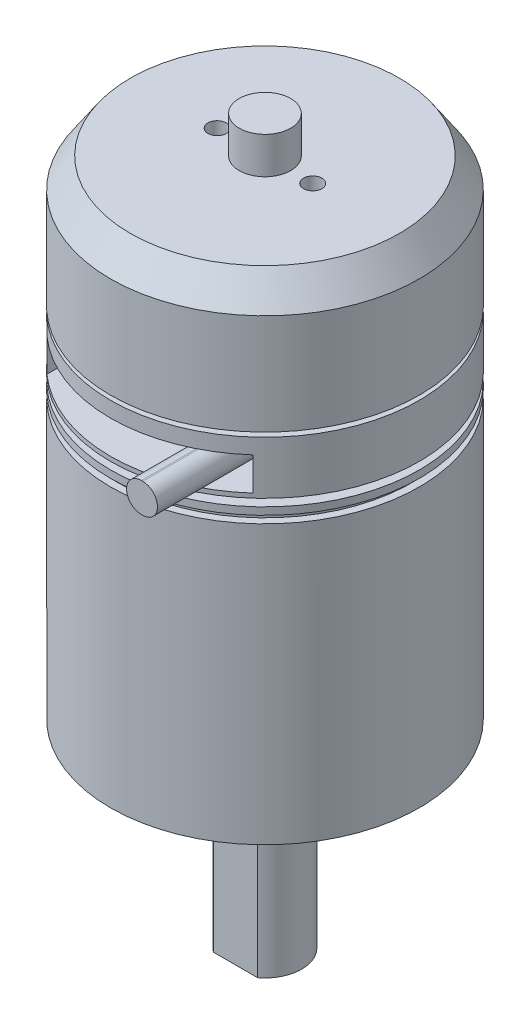
ISO-10303-21;
HEADER;
FILE_DESCRIPTION(('STEP AP214'),'2;1');
FILE_NAME('part.step','',(''),(''),'','','');
FILE_SCHEMA(('AUTOMOTIVE_DESIGN { 1 0 10303 214 1 1 1 1 }'));
ENDSEC;
DATA;
#1=APPLICATION_CONTEXT('core data for automotive mechanical design processes');
#2=APPLICATION_PROTOCOL_DEFINITION('international standard','automotive_design',2000,#1);
#3=PRODUCT_CONTEXT('',#1,'mechanical');
#4=PRODUCT('Part','Part','',(#3));
#5=PRODUCT_RELATED_PRODUCT_CATEGORY('part','',(#4));
#6=PRODUCT_DEFINITION_FORMATION('','',#4);
#7=PRODUCT_DEFINITION_CONTEXT('part definition',#1,'design');
#8=PRODUCT_DEFINITION('design','',#6,#7);
#9=PRODUCT_DEFINITION_SHAPE('','',#8);
#10=(LENGTH_UNIT() NAMED_UNIT(*) SI_UNIT(.MILLI.,.METRE.));
#11=(NAMED_UNIT(*) PLANE_ANGLE_UNIT() SI_UNIT($,.RADIAN.));
#12=(NAMED_UNIT(*) SI_UNIT($,.STERADIAN.) SOLID_ANGLE_UNIT());
#13=UNCERTAINTY_MEASURE_WITH_UNIT(LENGTH_MEASURE(1.E-05),#10,'distance_accuracy_value','');
#14=(GEOMETRIC_REPRESENTATION_CONTEXT(3) GLOBAL_UNCERTAINTY_ASSIGNED_CONTEXT((#13)) GLOBAL_UNIT_ASSIGNED_CONTEXT((#10,
#11,#12)) REPRESENTATION_CONTEXT('',''));
#15=CARTESIAN_POINT('',(0.,0.,0.));
#16=DIRECTION('',(0.,0.,1.));
#17=DIRECTION('',(1.,0.,0.));
#18=AXIS2_PLACEMENT_3D('',#15,#16,#17);
#19=CARTESIAN_POINT('',(0.,0.,11.));
#20=DIRECTION('',(0.,0.,1.));
#21=DIRECTION('',(1.,0.,0.));
#22=AXIS2_PLACEMENT_3D('',#19,#20,#21);
#23=PLANE('',#22);
#24=DIRECTION('',(0.,1.,0.));
#25=VECTOR('',#24,1.);
#26=CARTESIAN_POINT('',(14.,18.3,11.));
#27=LINE('',#26,#25);
#28=CARTESIAN_POINT('',(14.,13.8,11.));
#29=VERTEX_POINT('',#28);
#30=CARTESIAN_POINT('',(14.,18.3,11.));
#31=VERTEX_POINT('',#30);
#32=EDGE_CURVE('E278',#29,#31,#27,.T.);
#33=ORIENTED_EDGE('',*,*,#32,.T.);
#34=DIRECTION('',(-1.,0.,0.));
#35=VECTOR('',#34,1.);
#36=CARTESIAN_POINT('',(-14.,18.3,11.));
#37=LINE('',#36,#35);
#38=CARTESIAN_POINT('',(-14.,18.3,11.));
#39=VERTEX_POINT('',#38);
#40=EDGE_CURVE('E281',#31,#39,#37,.T.);
#41=ORIENTED_EDGE('',*,*,#40,.T.);
#42=DIRECTION('',(0.,-1.,0.));
#43=VECTOR('',#42,1.);
#44=CARTESIAN_POINT('',(-14.,18.3,11.));
#45=LINE('',#44,#43);
#46=CARTESIAN_POINT('',(-14.,13.8,11.));
#47=VERTEX_POINT('',#46);
#48=EDGE_CURVE('E285',#39,#47,#45,.T.);
#49=ORIENTED_EDGE('',*,*,#48,.T.);
#50=DIRECTION('',(1.,0.,0.));
#51=VECTOR('',#50,1.);
#52=CARTESIAN_POINT('',(-14.,13.8,11.));
#53=LINE('',#52,#51);
#54=EDGE_CURVE('E289',#47,#29,#53,.T.);
#55=ORIENTED_EDGE('',*,*,#54,.T.);
#56=EDGE_LOOP('',(#33,#41,#49,#55));
#57=FACE_BOUND('',#56,.T.);
#58=DIRECTION('',(1.,0.,0.));
#59=VECTOR('',#58,1.);
#60=CARTESIAN_POINT('',(9.18505632343501,14.0531944170925,11.));
#61=LINE('',#60,#59);
#62=CARTESIAN_POINT('',(9.18505632343501,14.0531944170925,11.));
#63=VERTEX_POINT('',#62);
#64=CARTESIAN_POINT('',(9.38505632343501,14.0531944170925,11.));
#65=VERTEX_POINT('',#64);
#66=EDGE_CURVE('E258',#63,#65,#61,.T.);
#67=ORIENTED_EDGE('',*,*,#66,.F.);
#68=CARTESIAN_POINT('',(9.18505632343501,16.0531944170925,11.));
#69=DIRECTION('',(0.,0.,1.));
#70=DIRECTION('',(1.,0.,0.));
#71=AXIS2_PLACEMENT_3D('',#68,#69,#70);
#72=CIRCLE('',#71,1.99999999999999);
#73=CARTESIAN_POINT('',(9.18505632343501,18.0531944170925,11.));
#74=VERTEX_POINT('',#73);
#75=EDGE_CURVE('E239',#74,#63,#72,.T.);
#76=ORIENTED_EDGE('',*,*,#75,.F.);
#77=DIRECTION('',(-1.,0.,0.));
#78=VECTOR('',#77,1.);
#79=CARTESIAN_POINT('',(9.18505632343501,18.0531944170925,11.));
#80=LINE('',#79,#78);
#81=CARTESIAN_POINT('',(9.38505632343501,18.0531944170925,11.));
#82=VERTEX_POINT('',#81);
#83=EDGE_CURVE('E245',#82,#74,#80,.T.);
#84=ORIENTED_EDGE('',*,*,#83,.F.);
#85=CARTESIAN_POINT('',(9.38505632343501,16.0531944170925,11.));
#86=DIRECTION('',(0.,0.,1.));
#87=DIRECTION('',(1.,0.,0.));
#88=AXIS2_PLACEMENT_3D('',#85,#86,#87);
#89=CIRCLE('',#88,2.);
#90=EDGE_CURVE('E261',#65,#82,#89,.T.);
#91=ORIENTED_EDGE('',*,*,#90,.F.);
#92=EDGE_LOOP('',(#67,#76,#84,#91));
#93=FACE_BOUND('',#92,.T.);
#94=ADVANCED_FACE('F43',(#57,#93),#23,.T.);
#95=CARTESIAN_POINT('',(0.,43.7,0.));
#96=DIRECTION('',(0.,1.,0.));
#97=DIRECTION('',(0.,0.,1.));
#98=AXIS2_PLACEMENT_3D('',#95,#96,#97);
#99=CYLINDRICAL_SURFACE('',#98,21.);
#100=CARTESIAN_POINT('',(0.,10.2,0.));
#101=DIRECTION('',(0.,1.,0.));
#102=DIRECTION('',(0.,0.,1.));
#103=AXIS2_PLACEMENT_3D('',#100,#101,#102);
#104=CIRCLE('',#103,21.);
#105=CARTESIAN_POINT('',(0.,10.2,21.));
#106=VERTEX_POINT('',#105);
#107=EDGE_CURVE('E369',#106,#106,#104,.T.);
#108=ORIENTED_EDGE('',*,*,#107,.F.);
#109=EDGE_LOOP('',(#108));
#110=FACE_BOUND('',#109,.T.);
#111=CARTESIAN_POINT('',(0.,-27.6,0.));
#112=DIRECTION('',(0.,1.,0.));
#113=DIRECTION('',(-1.,0.,0.));
#114=AXIS2_PLACEMENT_3D('',#111,#112,#113);
#115=CIRCLE('',#114,21.);
#116=CARTESIAN_POINT('',(-21.,-27.6,0.));
#117=VERTEX_POINT('',#116);
#118=EDGE_CURVE('E193',#117,#117,#115,.T.);
#119=ORIENTED_EDGE('',*,*,#118,.T.);
#120=EDGE_LOOP('',(#119));
#121=FACE_BOUND('',#120,.T.);
#122=ADVANCED_FACE('F45',(#110,#121),#99,.T.);
#123=CARTESIAN_POINT('',(21.,10.2,0.));
#124=DIRECTION('',(0.,-1.,0.));
#125=DIRECTION('',(0.,0.,-1.));
#126=AXIS2_PLACEMENT_3D('',#123,#124,#125);
#127=PLANE('',#126);
#128=CARTESIAN_POINT('',(0.,10.2,0.));
#129=DIRECTION('',(0.,1.,0.));
#130=DIRECTION('',(0.,0.,1.));
#131=AXIS2_PLACEMENT_3D('',#128,#129,#130);
#132=CIRCLE('',#131,20.);
#133=CARTESIAN_POINT('',(0.,10.2,20.));
#134=VERTEX_POINT('',#133);
#135=EDGE_CURVE('E365',#134,#134,#132,.T.);
#136=ORIENTED_EDGE('',*,*,#135,.F.);
#137=EDGE_LOOP('',(#136));
#138=FACE_BOUND('',#137,.T.);
#139=ORIENTED_EDGE('',*,*,#107,.T.);
#140=EDGE_LOOP('',(#139));
#141=FACE_BOUND('',#140,.T.);
#142=ADVANCED_FACE('F416',(#138,#141),#127,.F.);
#143=CARTESIAN_POINT('',(0.,43.7,0.));
#144=DIRECTION('',(0.,1.,0.));
#145=DIRECTION('',(0.,0.,1.));
#146=AXIS2_PLACEMENT_3D('',#143,#144,#145);
#147=CYLINDRICAL_SURFACE('',#146,20.);
#148=CARTESIAN_POINT('',(0.,11.2,0.));
#149=DIRECTION('',(0.,1.,0.));
#150=DIRECTION('',(0.,0.,1.));
#151=AXIS2_PLACEMENT_3D('',#148,#149,#150);
#152=CIRCLE('',#151,20.);
#153=CARTESIAN_POINT('',(0.,11.2,20.));
#154=VERTEX_POINT('',#153);
#155=EDGE_CURVE('E361',#154,#154,#152,.T.);
#156=ORIENTED_EDGE('',*,*,#155,.F.);
#157=EDGE_LOOP('',(#156));
#158=FACE_BOUND('',#157,.T.);
#159=ORIENTED_EDGE('',*,*,#135,.T.);
#160=EDGE_LOOP('',(#159));
#161=FACE_BOUND('',#160,.T.);
#162=ADVANCED_FACE('F480',(#158,#161),#147,.T.);
#163=CARTESIAN_POINT('',(20.,11.2,0.));
#164=DIRECTION('',(0.,1.,0.));
#165=DIRECTION('',(0.,0.,1.));
#166=AXIS2_PLACEMENT_3D('',#163,#164,#165);
#167=PLANE('',#166);
#168=CARTESIAN_POINT('',(0.,11.2,0.));
#169=DIRECTION('',(0.,1.,0.));
#170=DIRECTION('',(0.,0.,1.));
#171=AXIS2_PLACEMENT_3D('',#168,#169,#170);
#172=CIRCLE('',#171,21.);
#173=CARTESIAN_POINT('',(0.,11.2,21.));
#174=VERTEX_POINT('',#173);
#175=EDGE_CURVE('E357',#174,#174,#172,.T.);
#176=ORIENTED_EDGE('',*,*,#175,.F.);
#177=EDGE_LOOP('',(#176));
#178=FACE_BOUND('',#177,.T.);
#179=ORIENTED_EDGE('',*,*,#155,.T.);
#180=EDGE_LOOP('',(#179));
#181=FACE_BOUND('',#180,.T.);
#182=ADVANCED_FACE('F476',(#178,#181),#167,.F.);
#183=CARTESIAN_POINT('',(0.,43.7,0.));
#184=DIRECTION('',(0.,1.,0.));
#185=DIRECTION('',(0.,0.,1.));
#186=AXIS2_PLACEMENT_3D('',#183,#184,#185);
#187=CYLINDRICAL_SURFACE('',#186,21.);
#188=CARTESIAN_POINT('',(0.,12.2,0.));
#189=DIRECTION('',(0.,1.,0.));
#190=DIRECTION('',(0.,0.,1.));
#191=AXIS2_PLACEMENT_3D('',#188,#189,#190);
#192=CIRCLE('',#191,21.);
#193=CARTESIAN_POINT('',(0.,12.2,21.));
#194=VERTEX_POINT('',#193);
#195=EDGE_CURVE('E353',#194,#194,#192,.T.);
#196=ORIENTED_EDGE('',*,*,#195,.F.);
#197=EDGE_LOOP('',(#196));
#198=FACE_BOUND('',#197,.T.);
#199=ORIENTED_EDGE('',*,*,#175,.T.);
#200=EDGE_LOOP('',(#199));
#201=FACE_BOUND('',#200,.T.);
#202=ADVANCED_FACE('F472',(#198,#201),#187,.T.);
#203=CARTESIAN_POINT('',(21.,12.2,0.));
#204=DIRECTION('',(0.,-1.,0.));
#205=DIRECTION('',(0.,0.,-1.));
#206=AXIS2_PLACEMENT_3D('',#203,#204,#205);
#207=PLANE('',#206);
#208=CARTESIAN_POINT('',(0.,12.2,0.));
#209=DIRECTION('',(0.,1.,0.));
#210=DIRECTION('',(0.,0.,1.));
#211=AXIS2_PLACEMENT_3D('',#208,#209,#210);
#212=CIRCLE('',#211,10.);
#213=CARTESIAN_POINT('',(0.,12.2,10.));
#214=VERTEX_POINT('',#213);
#215=EDGE_CURVE('E349',#214,#214,#212,.T.);
#216=ORIENTED_EDGE('',*,*,#215,.F.);
#217=EDGE_LOOP('',(#216));
#218=FACE_BOUND('',#217,.T.);
#219=ORIENTED_EDGE('',*,*,#195,.T.);
#220=EDGE_LOOP('',(#219));
#221=FACE_BOUND('',#220,.T.);
#222=ADVANCED_FACE('F468',(#218,#221),#207,.F.);
#223=CARTESIAN_POINT('',(0.,43.7,0.));
#224=DIRECTION('',(0.,1.,0.));
#225=DIRECTION('',(0.,0.,1.));
#226=AXIS2_PLACEMENT_3D('',#223,#224,#225);
#227=CYLINDRICAL_SURFACE('',#226,10.);
#228=CARTESIAN_POINT('',(0.,13.2,0.));
#229=DIRECTION('',(0.,1.,0.));
#230=DIRECTION('',(0.,0.,1.));
#231=AXIS2_PLACEMENT_3D('',#228,#229,#230);
#232=CIRCLE('',#231,10.);
#233=CARTESIAN_POINT('',(0.,13.2,10.));
#234=VERTEX_POINT('',#233);
#235=EDGE_CURVE('E345',#234,#234,#232,.T.);
#236=ORIENTED_EDGE('',*,*,#235,.F.);
#237=EDGE_LOOP('',(#236));
#238=FACE_BOUND('',#237,.T.);
#239=ORIENTED_EDGE('',*,*,#215,.T.);
#240=EDGE_LOOP('',(#239));
#241=FACE_BOUND('',#240,.T.);
#242=ADVANCED_FACE('F464',(#238,#241),#227,.T.);
#243=CARTESIAN_POINT('',(10.,13.2,0.));
#244=DIRECTION('',(0.,1.,0.));
#245=DIRECTION('',(0.,0.,1.));
#246=AXIS2_PLACEMENT_3D('',#243,#244,#245);
#247=PLANE('',#246);
#248=CARTESIAN_POINT('',(0.,13.2,0.));
#249=DIRECTION('',(0.,1.,0.));
#250=DIRECTION('',(0.,0.,1.));
#251=AXIS2_PLACEMENT_3D('',#248,#249,#250);
#252=CIRCLE('',#251,21.);
#253=CARTESIAN_POINT('',(0.,13.2,21.));
#254=VERTEX_POINT('',#253);
#255=EDGE_CURVE('E341',#254,#254,#252,.T.);
#256=ORIENTED_EDGE('',*,*,#255,.F.);
#257=EDGE_LOOP('',(#256));
#258=FACE_BOUND('',#257,.T.);
#259=ORIENTED_EDGE('',*,*,#235,.T.);
#260=EDGE_LOOP('',(#259));
#261=FACE_BOUND('',#260,.T.);
#262=ADVANCED_FACE('F461',(#258,#261),#247,.F.);
#263=CARTESIAN_POINT('',(0.,43.7,0.));
#264=DIRECTION('',(0.,1.,0.));
#265=DIRECTION('',(0.,0.,1.));
#266=AXIS2_PLACEMENT_3D('',#263,#264,#265);
#267=CYLINDRICAL_SURFACE('',#266,21.);
#268=CARTESIAN_POINT('',(0.,18.3,0.));
#269=DIRECTION('',(0.,1.,0.));
#270=DIRECTION('',(0.,0.,1.));
#271=AXIS2_PLACEMENT_3D('',#268,#269,#270);
#272=CIRCLE('',#271,21.);
#273=CARTESIAN_POINT('',(-14.,18.3,15.6524758424985));
#274=VERTEX_POINT('',#273);
#275=CARTESIAN_POINT('',(14.,18.3,15.6524758424985));
#276=VERTEX_POINT('',#275);
#277=EDGE_CURVE('E373',#274,#276,#272,.T.);
#278=ORIENTED_EDGE('',*,*,#277,.T.);
#279=DIRECTION('',(0.,1.,0.));
#280=VECTOR('',#279,1.);
#281=CARTESIAN_POINT('',(14.,43.7,15.6524758424985));
#282=LINE('',#281,#280);
#283=CARTESIAN_POINT('',(14.,13.8,15.6524758424985));
#284=VERTEX_POINT('',#283);
#285=EDGE_CURVE('E11',#276,#284,#282,.F.);
#286=ORIENTED_EDGE('',*,*,#285,.T.);
#287=CARTESIAN_POINT('',(0.,13.8,0.));
#288=DIRECTION('',(0.,-1.,0.));
#289=DIRECTION('',(0.,0.,-1.));
#290=AXIS2_PLACEMENT_3D('',#287,#288,#289);
#291=CIRCLE('',#290,21.);
#292=CARTESIAN_POINT('',(-14.,13.8,15.6524758424985));
#293=VERTEX_POINT('',#292);
#294=EDGE_CURVE('E52',#284,#293,#291,.T.);
#295=ORIENTED_EDGE('',*,*,#294,.T.);
#296=DIRECTION('',(0.,1.,0.));
#297=VECTOR('',#296,1.);
#298=CARTESIAN_POINT('',(-14.,43.7,15.6524758424985));
#299=LINE('',#298,#297);
#300=EDGE_CURVE('E376',#293,#274,#299,.T.);
#301=ORIENTED_EDGE('',*,*,#300,.T.);
#302=EDGE_LOOP('',(#278,#286,#295,#301));
#303=FACE_BOUND('',#302,.T.);
#304=CARTESIAN_POINT('',(0.,20.4,0.));
#305=DIRECTION('',(0.,1.,0.));
#306=DIRECTION('',(0.,0.,1.));
#307=AXIS2_PLACEMENT_3D('',#304,#305,#306);
#308=CIRCLE('',#307,21.);
#309=CARTESIAN_POINT('',(0.,20.4,21.));
#310=VERTEX_POINT('',#309);
#311=EDGE_CURVE('E337',#310,#310,#308,.T.);
#312=ORIENTED_EDGE('',*,*,#311,.F.);
#313=EDGE_LOOP('',(#312));
#314=FACE_BOUND('',#313,.T.);
#315=ORIENTED_EDGE('',*,*,#255,.T.);
#316=EDGE_LOOP('',(#315));
#317=FACE_BOUND('',#316,.T.);
#318=ADVANCED_FACE('F382',(#303,#314,#317),#267,.T.);
#319=CARTESIAN_POINT('',(21.,20.4,0.));
#320=DIRECTION('',(0.,-1.,0.));
#321=DIRECTION('',(0.,0.,-1.));
#322=AXIS2_PLACEMENT_3D('',#319,#320,#321);
#323=PLANE('',#322);
#324=CARTESIAN_POINT('',(0.,20.4,0.));
#325=DIRECTION('',(0.,1.,0.));
#326=DIRECTION('',(0.,0.,1.));
#327=AXIS2_PLACEMENT_3D('',#324,#325,#326);
#328=CIRCLE('',#327,5.);
#329=CARTESIAN_POINT('',(0.,20.4,5.));
#330=VERTEX_POINT('',#329);
#331=EDGE_CURVE('E333',#330,#330,#328,.T.);
#332=ORIENTED_EDGE('',*,*,#331,.F.);
#333=EDGE_LOOP('',(#332));
#334=FACE_BOUND('',#333,.T.);
#335=ORIENTED_EDGE('',*,*,#311,.T.);
#336=EDGE_LOOP('',(#335));
#337=FACE_BOUND('',#336,.T.);
#338=ADVANCED_FACE('F454',(#334,#337),#323,.F.);
#339=CARTESIAN_POINT('',(0.,43.7,0.));
#340=DIRECTION('',(0.,1.,0.));
#341=DIRECTION('',(0.,0.,1.));
#342=AXIS2_PLACEMENT_3D('',#339,#340,#341);
#343=CYLINDRICAL_SURFACE('',#342,5.);
#344=CARTESIAN_POINT('',(0.,21.,0.));
#345=DIRECTION('',(0.,1.,0.));
#346=DIRECTION('',(0.,0.,1.));
#347=AXIS2_PLACEMENT_3D('',#344,#345,#346);
#348=CIRCLE('',#347,5.);
#349=CARTESIAN_POINT('',(0.,21.,5.));
#350=VERTEX_POINT('',#349);
#351=EDGE_CURVE('E329',#350,#350,#348,.T.);
#352=ORIENTED_EDGE('',*,*,#351,.F.);
#353=EDGE_LOOP('',(#352));
#354=FACE_BOUND('',#353,.T.);
#355=ORIENTED_EDGE('',*,*,#331,.T.);
#356=EDGE_LOOP('',(#355));
#357=FACE_BOUND('',#356,.T.);
#358=ADVANCED_FACE('F450',(#354,#357),#343,.T.);
#359=CARTESIAN_POINT('',(5.,21.,0.));
#360=DIRECTION('',(0.,1.,0.));
#361=DIRECTION('',(0.,0.,1.));
#362=AXIS2_PLACEMENT_3D('',#359,#360,#361);
#363=PLANE('',#362);
#364=CARTESIAN_POINT('',(0.,21.,0.));
#365=DIRECTION('',(0.,1.,0.));
#366=DIRECTION('',(0.,0.,1.));
#367=AXIS2_PLACEMENT_3D('',#364,#365,#366);
#368=CIRCLE('',#367,21.);
#369=CARTESIAN_POINT('',(0.,21.,21.));
#370=VERTEX_POINT('',#369);
#371=EDGE_CURVE('E325',#370,#370,#368,.T.);
#372=ORIENTED_EDGE('',*,*,#371,.F.);
#373=EDGE_LOOP('',(#372));
#374=FACE_BOUND('',#373,.T.);
#375=ORIENTED_EDGE('',*,*,#351,.T.);
#376=EDGE_LOOP('',(#375));
#377=FACE_BOUND('',#376,.T.);
#378=ADVANCED_FACE('F446',(#374,#377),#363,.F.);
#379=CARTESIAN_POINT('',(0.,43.7,0.));
#380=DIRECTION('',(0.,1.,0.));
#381=DIRECTION('',(0.,0.,1.));
#382=AXIS2_PLACEMENT_3D('',#379,#380,#381);
#383=CYLINDRICAL_SURFACE('',#382,21.);
#384=CARTESIAN_POINT('',(0.,34.7,0.));
#385=DIRECTION('',(0.,1.,0.));
#386=DIRECTION('',(0.,0.,1.));
#387=AXIS2_PLACEMENT_3D('',#384,#385,#386);
#388=CIRCLE('',#387,21.);
#389=CARTESIAN_POINT('',(0.,34.7,21.));
#390=VERTEX_POINT('',#389);
#391=EDGE_CURVE('E321',#390,#390,#388,.T.);
#392=ORIENTED_EDGE('',*,*,#391,.F.);
#393=EDGE_LOOP('',(#392));
#394=FACE_BOUND('',#393,.T.);
#395=ORIENTED_EDGE('',*,*,#371,.T.);
#396=EDGE_LOOP('',(#395));
#397=FACE_BOUND('',#396,.T.);
#398=ADVANCED_FACE('F442',(#394,#397),#383,.T.);
#399=CARTESIAN_POINT('',(0.,34.7,0.));
#400=DIRECTION('',(0.,-1.,0.));
#401=DIRECTION('',(0.,0.,-1.));
#402=AXIS2_PLACEMENT_3D('',#399,#400,#401);
#403=CONICAL_SURFACE('',#402,21.,0.593749666710772);
#404=CARTESIAN_POINT('',(0.,38.7,0.));
#405=DIRECTION('',(0.,1.,0.));
#406=DIRECTION('',(0.,0.,1.));
#407=AXIS2_PLACEMENT_3D('',#404,#405,#406);
#408=CIRCLE('',#407,18.3);
#409=CARTESIAN_POINT('',(0.,38.7,18.3));
#410=VERTEX_POINT('',#409);
#411=EDGE_CURVE('E317',#410,#410,#408,.T.);
#412=ORIENTED_EDGE('',*,*,#411,.F.);
#413=EDGE_LOOP('',(#412));
#414=FACE_BOUND('',#413,.T.);
#415=ORIENTED_EDGE('',*,*,#391,.T.);
#416=EDGE_LOOP('',(#415));
#417=FACE_BOUND('',#416,.T.);
#418=ADVANCED_FACE('F438',(#414,#417),#403,.T.);
#419=CARTESIAN_POINT('',(18.3,38.7,0.));
#420=DIRECTION('',(0.,-1.,0.));
#421=DIRECTION('',(0.,0.,-1.));
#422=AXIS2_PLACEMENT_3D('',#419,#420,#421);
#423=PLANE('',#422);
#424=CARTESIAN_POINT('',(-6.5,38.7,0.));
#425=DIRECTION('',(0.,1.,0.));
#426=DIRECTION('',(0.,0.,1.));
#427=AXIS2_PLACEMENT_3D('',#424,#425,#426);
#428=CIRCLE('',#427,1.24999999999999);
#429=CARTESIAN_POINT('',(-6.5,38.7,1.24999999999999));
#430=VERTEX_POINT('',#429);
#431=EDGE_CURVE('E223',#430,#430,#428,.T.);
#432=ORIENTED_EDGE('',*,*,#431,.F.);
#433=EDGE_LOOP('',(#432));
#434=FACE_BOUND('',#433,.T.);
#435=CARTESIAN_POINT('',(6.5,38.7,0.));
#436=DIRECTION('',(0.,1.,0.));
#437=DIRECTION('',(0.,0.,1.));
#438=AXIS2_PLACEMENT_3D('',#435,#436,#437);
#439=CIRCLE('',#438,1.24999999999999);
#440=CARTESIAN_POINT('',(6.5,38.7,1.24999999999999));
#441=VERTEX_POINT('',#440);
#442=EDGE_CURVE('E231',#441,#441,#439,.T.);
#443=ORIENTED_EDGE('',*,*,#442,.F.);
#444=EDGE_LOOP('',(#443));
#445=FACE_BOUND('',#444,.T.);
#446=CARTESIAN_POINT('',(0.,38.7,0.));
#447=DIRECTION('',(0.,1.,0.));
#448=DIRECTION('',(0.,0.,1.));
#449=AXIS2_PLACEMENT_3D('',#446,#447,#448);
#450=CIRCLE('',#449,3.5);
#451=CARTESIAN_POINT('',(0.,38.7,3.5));
#452=VERTEX_POINT('',#451);
#453=EDGE_CURVE('E313',#452,#452,#450,.T.);
#454=ORIENTED_EDGE('',*,*,#453,.F.);
#455=EDGE_LOOP('',(#454));
#456=FACE_BOUND('',#455,.T.);
#457=ORIENTED_EDGE('',*,*,#411,.T.);
#458=EDGE_LOOP('',(#457));
#459=FACE_BOUND('',#458,.T.);
#460=ADVANCED_FACE('F434',(#434,#445,#456,#459),#423,.F.);
#461=CARTESIAN_POINT('',(0.,43.7,0.));
#462=DIRECTION('',(0.,1.,0.));
#463=DIRECTION('',(0.,0.,1.));
#464=AXIS2_PLACEMENT_3D('',#461,#462,#463);
#465=CYLINDRICAL_SURFACE('',#464,3.5);
#466=CARTESIAN_POINT('',(0.,43.7,0.));
#467=DIRECTION('',(0.,1.,0.));
#468=DIRECTION('',(0.,0.,1.));
#469=AXIS2_PLACEMENT_3D('',#466,#467,#468);
#470=CIRCLE('',#469,3.5);
#471=CARTESIAN_POINT('',(0.,43.7,3.5));
#472=VERTEX_POINT('',#471);
#473=EDGE_CURVE('E298',#472,#472,#470,.T.);
#474=ORIENTED_EDGE('',*,*,#473,.F.);
#475=EDGE_LOOP('',(#474));
#476=FACE_BOUND('',#475,.T.);
#477=ORIENTED_EDGE('',*,*,#453,.T.);
#478=EDGE_LOOP('',(#477));
#479=FACE_BOUND('',#478,.T.);
#480=ADVANCED_FACE('F428',(#476,#479),#465,.T.);
#481=CARTESIAN_POINT('',(3.5,43.7,0.));
#482=DIRECTION('',(0.,-1.,0.));
#483=DIRECTION('',(0.,0.,-1.));
#484=AXIS2_PLACEMENT_3D('',#481,#482,#483);
#485=PLANE('',#484);
#486=ORIENTED_EDGE('',*,*,#473,.T.);
#487=EDGE_LOOP('',(#486));
#488=FACE_BOUND('',#487,.T.);
#489=ADVANCED_FACE('F424',(#488),#485,.F.);
#490=CARTESIAN_POINT('',(14.,18.3,11.));
#491=DIRECTION('',(1.,0.,0.));
#492=DIRECTION('',(0.,0.,-1.));
#493=AXIS2_PLACEMENT_3D('',#490,#491,#492);
#494=PLANE('',#493);
#495=DIRECTION('',(0.,0.,1.));
#496=VECTOR('',#495,1.);
#497=CARTESIAN_POINT('',(14.,18.3,11.));
#498=LINE('',#497,#496);
#499=EDGE_CURVE('E293',#31,#276,#498,.T.);
#500=ORIENTED_EDGE('',*,*,#499,.F.);
#501=ORIENTED_EDGE('',*,*,#32,.F.);
#502=DIRECTION('',(0.,0.,1.));
#503=VECTOR('',#502,1.);
#504=CARTESIAN_POINT('',(14.,13.8,11.));
#505=LINE('',#504,#503);
#506=EDGE_CURVE('E294',#29,#284,#505,.T.);
#507=ORIENTED_EDGE('',*,*,#506,.T.);
#508=ORIENTED_EDGE('',*,*,#285,.F.);
#509=EDGE_LOOP('',(#500,#501,#507,#508));
#510=FACE_BOUND('',#509,.T.);
#511=ADVANCED_FACE('F390',(#510),#494,.F.);
#512=CARTESIAN_POINT('',(-14.,13.8,11.));
#513=DIRECTION('',(0.,-1.,0.));
#514=DIRECTION('',(0.,0.,-1.));
#515=AXIS2_PLACEMENT_3D('',#512,#513,#514);
#516=PLANE('',#515);
#517=ORIENTED_EDGE('',*,*,#506,.F.);
#518=ORIENTED_EDGE('',*,*,#54,.F.);
#519=DIRECTION('',(0.,0.,1.));
#520=VECTOR('',#519,1.);
#521=CARTESIAN_POINT('',(-14.,13.8,11.));
#522=LINE('',#521,#520);
#523=EDGE_CURVE('E299',#47,#293,#522,.T.);
#524=ORIENTED_EDGE('',*,*,#523,.T.);
#525=ORIENTED_EDGE('',*,*,#294,.F.);
#526=EDGE_LOOP('',(#517,#518,#524,#525));
#527=FACE_BOUND('',#526,.T.);
#528=ADVANCED_FACE('F386',(#527),#516,.F.);
#529=CARTESIAN_POINT('',(-14.,18.3,11.));
#530=DIRECTION('',(-1.,0.,0.));
#531=DIRECTION('',(0.,-1.,0.));
#532=AXIS2_PLACEMENT_3D('',#529,#530,#531);
#533=PLANE('',#532);
#534=ORIENTED_EDGE('',*,*,#523,.F.);
#535=ORIENTED_EDGE('',*,*,#48,.F.);
#536=DIRECTION('',(0.,0.,1.));
#537=VECTOR('',#536,1.);
#538=CARTESIAN_POINT('',(-14.,18.3,11.));
#539=LINE('',#538,#537);
#540=EDGE_CURVE('E303',#39,#274,#539,.T.);
#541=ORIENTED_EDGE('',*,*,#540,.T.);
#542=ORIENTED_EDGE('',*,*,#300,.F.);
#543=EDGE_LOOP('',(#534,#535,#541,#542));
#544=FACE_BOUND('',#543,.T.);
#545=ADVANCED_FACE('F396',(#544),#533,.F.);
#546=CARTESIAN_POINT('',(-14.,18.3,11.));
#547=DIRECTION('',(0.,1.,0.));
#548=DIRECTION('',(0.,0.,1.));
#549=AXIS2_PLACEMENT_3D('',#546,#547,#548);
#550=PLANE('',#549);
#551=ORIENTED_EDGE('',*,*,#277,.F.);
#552=ORIENTED_EDGE('',*,*,#540,.F.);
#553=ORIENTED_EDGE('',*,*,#40,.F.);
#554=ORIENTED_EDGE('',*,*,#499,.T.);
#555=EDGE_LOOP('',(#551,#552,#553,#554));
#556=FACE_BOUND('',#555,.T.);
#557=ADVANCED_FACE('F398',(#556),#550,.F.);
#558=CARTESIAN_POINT('',(9.18505632343501,16.0531944170925,26.));
#559=DIRECTION('',(0.,0.,-1.));
#560=DIRECTION('',(-1.,0.,0.));
#561=AXIS2_PLACEMENT_3D('',#558,#559,#560);
#562=CYLINDRICAL_SURFACE('',#561,1.99999999999999);
#563=ORIENTED_EDGE('',*,*,#75,.T.);
#564=DIRECTION('',(0.,0.,-1.));
#565=VECTOR('',#564,1.);
#566=CARTESIAN_POINT('',(9.18505632343501,14.0531944170925,26.));
#567=LINE('',#566,#565);
#568=CARTESIAN_POINT('',(9.18505632343501,14.0531944170925,26.));
#569=VERTEX_POINT('',#568);
#570=EDGE_CURVE('E275',#569,#63,#567,.T.);
#571=ORIENTED_EDGE('',*,*,#570,.F.);
#572=CARTESIAN_POINT('',(9.18505632343501,16.0531944170925,26.));
#573=DIRECTION('',(0.,0.,1.));
#574=DIRECTION('',(1.,0.,0.));
#575=AXIS2_PLACEMENT_3D('',#572,#573,#574);
#576=CIRCLE('',#575,1.99999999999999);
#577=CARTESIAN_POINT('',(9.18505632343501,18.0531944170925,26.));
#578=VERTEX_POINT('',#577);
#579=EDGE_CURVE('E240',#578,#569,#576,.T.);
#580=ORIENTED_EDGE('',*,*,#579,.F.);
#581=DIRECTION('',(0.,0.,-1.));
#582=VECTOR('',#581,1.);
#583=CARTESIAN_POINT('',(9.18505632343501,18.0531944170925,26.));
#584=LINE('',#583,#582);
#585=EDGE_CURVE('E254',#578,#74,#584,.T.);
#586=ORIENTED_EDGE('',*,*,#585,.T.);
#587=EDGE_LOOP('',(#563,#571,#580,#586));
#588=FACE_BOUND('',#587,.T.);
#589=ADVANCED_FACE('F400',(#588),#562,.T.);
#590=CARTESIAN_POINT('',(9.18505632343501,14.0531944170925,26.));
#591=DIRECTION('',(0.,1.,0.));
#592=DIRECTION('',(-1.,0.,0.));
#593=AXIS2_PLACEMENT_3D('',#590,#591,#592);
#594=PLANE('',#593);
#595=ORIENTED_EDGE('',*,*,#66,.T.);
#596=DIRECTION('',(0.,0.,-1.));
#597=VECTOR('',#596,1.);
#598=CARTESIAN_POINT('',(9.38505632343501,14.0531944170925,26.));
#599=LINE('',#598,#597);
#600=CARTESIAN_POINT('',(9.38505632343501,14.0531944170925,26.));
#601=VERTEX_POINT('',#600);
#602=EDGE_CURVE('E271',#601,#65,#599,.T.);
#603=ORIENTED_EDGE('',*,*,#602,.F.);
#604=DIRECTION('',(1.,0.,0.));
#605=VECTOR('',#604,1.);
#606=CARTESIAN_POINT('',(9.18505632343501,14.0531944170925,26.));
#607=LINE('',#606,#605);
#608=EDGE_CURVE('E244',#569,#601,#607,.T.);
#609=ORIENTED_EDGE('',*,*,#608,.F.);
#610=ORIENTED_EDGE('',*,*,#570,.T.);
#611=EDGE_LOOP('',(#595,#603,#609,#610));
#612=FACE_BOUND('',#611,.T.);
#613=ADVANCED_FACE('F406',(#612),#594,.F.);
#614=CARTESIAN_POINT('',(9.38505632343501,16.0531944170925,26.));
#615=DIRECTION('',(0.,0.,-1.));
#616=DIRECTION('',(-1.,0.,0.));
#617=AXIS2_PLACEMENT_3D('',#614,#615,#616);
#618=CYLINDRICAL_SURFACE('',#617,2.);
#619=ORIENTED_EDGE('',*,*,#90,.T.);
#620=DIRECTION('',(0.,0.,-1.));
#621=VECTOR('',#620,1.);
#622=CARTESIAN_POINT('',(9.38505632343501,18.0531944170925,26.));
#623=LINE('',#622,#621);
#624=CARTESIAN_POINT('',(9.38505632343501,18.0531944170925,26.));
#625=VERTEX_POINT('',#624);
#626=EDGE_CURVE('E66',#625,#82,#623,.T.);
#627=ORIENTED_EDGE('',*,*,#626,.F.);
#628=CARTESIAN_POINT('',(9.38505632343501,16.0531944170925,26.));
#629=DIRECTION('',(0.,0.,1.));
#630=DIRECTION('',(1.,0.,0.));
#631=AXIS2_PLACEMENT_3D('',#628,#629,#630);
#632=CIRCLE('',#631,2.);
#633=EDGE_CURVE('E248',#601,#625,#632,.T.);
#634=ORIENTED_EDGE('',*,*,#633,.F.);
#635=ORIENTED_EDGE('',*,*,#602,.T.);
#636=EDGE_LOOP('',(#619,#627,#634,#635));
#637=FACE_BOUND('',#636,.T.);
#638=ADVANCED_FACE('F560',(#637),#618,.T.);
#639=CARTESIAN_POINT('',(9.18505632343501,18.0531944170925,26.));
#640=DIRECTION('',(0.,-1.,0.));
#641=DIRECTION('',(1.,0.,0.));
#642=AXIS2_PLACEMENT_3D('',#639,#640,#641);
#643=PLANE('',#642);
#644=ORIENTED_EDGE('',*,*,#83,.T.);
#645=ORIENTED_EDGE('',*,*,#585,.F.);
#646=DIRECTION('',(-1.,0.,0.));
#647=VECTOR('',#646,1.);
#648=CARTESIAN_POINT('',(9.18505632343501,18.0531944170925,26.));
#649=LINE('',#648,#647);
#650=EDGE_CURVE('E251',#625,#578,#649,.T.);
#651=ORIENTED_EDGE('',*,*,#650,.F.);
#652=ORIENTED_EDGE('',*,*,#626,.T.);
#653=EDGE_LOOP('',(#644,#645,#651,#652));
#654=FACE_BOUND('',#653,.T.);
#655=ADVANCED_FACE('F556',(#654),#643,.F.);
#656=CARTESIAN_POINT('',(9.18505632343501,16.0531944170925,26.));
#657=DIRECTION('',(0.,0.,1.));
#658=DIRECTION('',(1.,0.,0.));
#659=AXIS2_PLACEMENT_3D('',#656,#657,#658);
#660=PLANE('',#659);
#661=ORIENTED_EDGE('',*,*,#579,.T.);
#662=ORIENTED_EDGE('',*,*,#608,.T.);
#663=ORIENTED_EDGE('',*,*,#633,.T.);
#664=ORIENTED_EDGE('',*,*,#650,.T.);
#665=EDGE_LOOP('',(#661,#662,#663,#664));
#666=FACE_BOUND('',#665,.T.);
#667=ADVANCED_FACE('F552',(#666),#660,.T.);
#668=CARTESIAN_POINT('',(6.5,34.7,0.));
#669=DIRECTION('',(0.,1.,0.));
#670=DIRECTION('',(0.,0.,1.));
#671=AXIS2_PLACEMENT_3D('',#668,#669,#670);
#672=CONICAL_SURFACE('',#671,1.25,1.02974425867665);
#673=CARTESIAN_POINT('',(6.5,33.9489242262155,0.));
#674=VERTEX_POINT('',#673);
#675=VERTEX_LOOP('',#674);
#676=FACE_BOUND('',#675,.T.);
#677=CARTESIAN_POINT('',(6.5,34.7,0.));
#678=DIRECTION('',(0.,1.,0.));
#679=DIRECTION('',(0.,0.,1.));
#680=AXIS2_PLACEMENT_3D('',#677,#678,#679);
#681=CIRCLE('',#680,1.25);
#682=CARTESIAN_POINT('',(6.5,34.7,1.25));
#683=VERTEX_POINT('',#682);
#684=EDGE_CURVE('E235',#683,#683,#681,.T.);
#685=ORIENTED_EDGE('',*,*,#684,.T.);
#686=EDGE_LOOP('',(#685));
#687=FACE_BOUND('',#686,.T.);
#688=ADVANCED_FACE('F548',(#676,#687),#672,.F.);
#689=CARTESIAN_POINT('',(6.5,38.7,0.));
#690=DIRECTION('',(0.,1.,0.));
#691=DIRECTION('',(0.,0.,1.));
#692=AXIS2_PLACEMENT_3D('',#689,#690,#691);
#693=CYLINDRICAL_SURFACE('',#692,1.24999999999999);
#694=ORIENTED_EDGE('',*,*,#684,.F.);
#695=EDGE_LOOP('',(#694));
#696=FACE_BOUND('',#695,.T.);
#697=ORIENTED_EDGE('',*,*,#442,.T.);
#698=EDGE_LOOP('',(#697));
#699=FACE_BOUND('',#698,.T.);
#700=ADVANCED_FACE('F544',(#696,#699),#693,.F.);
#701=CARTESIAN_POINT('',(-6.5,34.7,0.));
#702=DIRECTION('',(0.,1.,0.));
#703=DIRECTION('',(0.,0.,1.));
#704=AXIS2_PLACEMENT_3D('',#701,#702,#703);
#705=CONICAL_SURFACE('',#704,1.25,1.02974425867665);
#706=CARTESIAN_POINT('',(-6.5,33.9489242262155,0.));
#707=VERTEX_POINT('',#706);
#708=VERTEX_LOOP('',#707);
#709=FACE_BOUND('',#708,.T.);
#710=CARTESIAN_POINT('',(-6.5,34.7,0.));
#711=DIRECTION('',(0.,1.,0.));
#712=DIRECTION('',(0.,0.,1.));
#713=AXIS2_PLACEMENT_3D('',#710,#711,#712);
#714=CIRCLE('',#713,1.25);
#715=CARTESIAN_POINT('',(-6.5,34.7,1.25));
#716=VERTEX_POINT('',#715);
#717=EDGE_CURVE('E227',#716,#716,#714,.T.);
#718=ORIENTED_EDGE('',*,*,#717,.T.);
#719=EDGE_LOOP('',(#718));
#720=FACE_BOUND('',#719,.T.);
#721=ADVANCED_FACE('F540',(#709,#720),#705,.F.);
#722=CARTESIAN_POINT('',(-6.5,38.7,0.));
#723=DIRECTION('',(0.,1.,0.));
#724=DIRECTION('',(0.,0.,1.));
#725=AXIS2_PLACEMENT_3D('',#722,#723,#724);
#726=CYLINDRICAL_SURFACE('',#725,1.24999999999999);
#727=ORIENTED_EDGE('',*,*,#717,.F.);
#728=EDGE_LOOP('',(#727));
#729=FACE_BOUND('',#728,.T.);
#730=ORIENTED_EDGE('',*,*,#431,.T.);
#731=EDGE_LOOP('',(#730));
#732=FACE_BOUND('',#731,.T.);
#733=ADVANCED_FACE('F534',(#729,#732),#726,.F.);
#734=CARTESIAN_POINT('',(0.,-54.6,0.));
#735=DIRECTION('',(0.,1.,0.));
#736=DIRECTION('',(-1.,0.,0.));
#737=AXIS2_PLACEMENT_3D('',#734,#735,#736);
#738=PLANE('',#737);
#739=CARTESIAN_POINT('',(0.,-54.6,0.));
#740=DIRECTION('',(0.,1.,0.));
#741=DIRECTION('',(-1.,0.,0.));
#742=AXIS2_PLACEMENT_3D('',#739,#740,#741);
#743=CIRCLE('',#742,5.);
#744=CARTESIAN_POINT('',(3.00000000000002,-54.6,4.));
#745=VERTEX_POINT('',#744);
#746=CARTESIAN_POINT('',(-3.,-54.6,4.));
#747=VERTEX_POINT('',#746);
#748=EDGE_CURVE('E219',#745,#747,#743,.T.);
#749=ORIENTED_EDGE('',*,*,#748,.F.);
#750=DIRECTION('',(1.,0.,0.));
#751=VECTOR('',#750,1.);
#752=CARTESIAN_POINT('',(-3.,-54.6,4.));
#753=LINE('',#752,#751);
#754=EDGE_CURVE('E180',#747,#745,#753,.T.);
#755=ORIENTED_EDGE('',*,*,#754,.F.);
#756=EDGE_LOOP('',(#749,#755));
#757=FACE_BOUND('',#756,.T.);
#758=ADVANCED_FACE('F528',(#757),#738,.F.);
#759=CARTESIAN_POINT('',(0.,8.7,0.));
#760=DIRECTION('',(0.,1.,0.));
#761=DIRECTION('',(-1.,0.,0.));
#762=AXIS2_PLACEMENT_3D('',#759,#760,#761);
#763=CYLINDRICAL_SURFACE('',#762,5.);
#764=ORIENTED_EDGE('',*,*,#748,.T.);
#765=DIRECTION('',(0.,-1.,0.));
#766=VECTOR('',#765,1.);
#767=CARTESIAN_POINT('',(-3.,-34.6,4.));
#768=LINE('',#767,#766);
#769=CARTESIAN_POINT('',(-3.,-34.6,4.));
#770=VERTEX_POINT('',#769);
#771=EDGE_CURVE('E186',#770,#747,#768,.T.);
#772=ORIENTED_EDGE('',*,*,#771,.F.);
#773=CARTESIAN_POINT('',(0.,-34.6,0.));
#774=DIRECTION('',(0.,-1.,0.));
#775=DIRECTION('',(1.,0.,0.));
#776=AXIS2_PLACEMENT_3D('',#773,#774,#775);
#777=CIRCLE('',#776,5.);
#778=CARTESIAN_POINT('',(3.00000000000001,-34.6,4.));
#779=VERTEX_POINT('',#778);
#780=EDGE_CURVE('E181',#779,#770,#777,.T.);
#781=ORIENTED_EDGE('',*,*,#780,.F.);
#782=DIRECTION('',(0.,-1.,0.));
#783=VECTOR('',#782,1.);
#784=CARTESIAN_POINT('',(3.00000000000001,-34.6,4.));
#785=LINE('',#784,#783);
#786=EDGE_CURVE('E189',#779,#745,#785,.T.);
#787=ORIENTED_EDGE('',*,*,#786,.T.);
#788=EDGE_LOOP('',(#764,#772,#781,#787));
#789=FACE_BOUND('',#788,.T.);
#790=CARTESIAN_POINT('',(0.,-30.5,0.));
#791=DIRECTION('',(0.,1.,0.));
#792=DIRECTION('',(-1.,0.,0.));
#793=AXIS2_PLACEMENT_3D('',#790,#791,#792);
#794=CIRCLE('',#793,5.);
#795=CARTESIAN_POINT('',(-5.,-30.5,0.));
#796=VERTEX_POINT('',#795);
#797=EDGE_CURVE('E215',#796,#796,#794,.T.);
#798=ORIENTED_EDGE('',*,*,#797,.F.);
#799=EDGE_LOOP('',(#798));
#800=FACE_BOUND('',#799,.T.);
#801=ADVANCED_FACE('F523',(#789,#800),#763,.T.);
#802=CARTESIAN_POINT('',(5.00000000000001,-30.5,0.));
#803=DIRECTION('',(0.,1.,0.));
#804=DIRECTION('',(-1.,0.,0.));
#805=AXIS2_PLACEMENT_3D('',#802,#803,#804);
#806=PLANE('',#805);
#807=CARTESIAN_POINT('',(0.,-30.5,0.));
#808=DIRECTION('',(0.,1.,0.));
#809=DIRECTION('',(-1.,0.,0.));
#810=AXIS2_PLACEMENT_3D('',#807,#808,#809);
#811=CIRCLE('',#810,8.275);
#812=CARTESIAN_POINT('',(-8.275,-30.5,0.));
#813=VERTEX_POINT('',#812);
#814=EDGE_CURVE('E211',#813,#813,#811,.T.);
#815=ORIENTED_EDGE('',*,*,#814,.F.);
#816=EDGE_LOOP('',(#815));
#817=FACE_BOUND('',#816,.T.);
#818=ORIENTED_EDGE('',*,*,#797,.T.);
#819=EDGE_LOOP('',(#818));
#820=FACE_BOUND('',#819,.T.);
#821=ADVANCED_FACE('F517',(#817,#820),#806,.F.);
#822=CARTESIAN_POINT('',(0.,8.7,0.));
#823=DIRECTION('',(0.,1.,0.));
#824=DIRECTION('',(-1.,0.,0.));
#825=AXIS2_PLACEMENT_3D('',#822,#823,#824);
#826=CYLINDRICAL_SURFACE('',#825,8.275);
#827=CARTESIAN_POINT('',(0.,-29.6,0.));
#828=DIRECTION('',(0.,1.,0.));
#829=DIRECTION('',(-1.,0.,0.));
#830=AXIS2_PLACEMENT_3D('',#827,#828,#829);
#831=CIRCLE('',#830,8.275);
#832=CARTESIAN_POINT('',(-8.275,-29.6,0.));
#833=VERTEX_POINT('',#832);
#834=EDGE_CURVE('E207',#833,#833,#831,.T.);
#835=ORIENTED_EDGE('',*,*,#834,.F.);
#836=EDGE_LOOP('',(#835));
#837=FACE_BOUND('',#836,.T.);
#838=ORIENTED_EDGE('',*,*,#814,.T.);
#839=EDGE_LOOP('',(#838));
#840=FACE_BOUND('',#839,.T.);
#841=ADVANCED_FACE('F511',(#837,#840),#826,.T.);
#842=CARTESIAN_POINT('',(13.,-29.6,0.));
#843=DIRECTION('',(0.,1.,0.));
#844=DIRECTION('',(-1.,0.,0.));
#845=AXIS2_PLACEMENT_3D('',#842,#843,#844);
#846=PLANE('',#845);
#847=CARTESIAN_POINT('',(0.,-29.6,0.));
#848=DIRECTION('',(0.,1.,0.));
#849=DIRECTION('',(-1.,0.,0.));
#850=AXIS2_PLACEMENT_3D('',#847,#848,#849);
#851=CIRCLE('',#850,13.);
#852=CARTESIAN_POINT('',(-13.,-29.6,0.));
#853=VERTEX_POINT('',#852);
#854=EDGE_CURVE('E203',#853,#853,#851,.T.);
#855=ORIENTED_EDGE('',*,*,#854,.F.);
#856=EDGE_LOOP('',(#855));
#857=FACE_BOUND('',#856,.T.);
#858=ORIENTED_EDGE('',*,*,#834,.T.);
#859=EDGE_LOOP('',(#858));
#860=FACE_BOUND('',#859,.T.);
#861=ADVANCED_FACE('F505',(#857,#860),#846,.F.);
#862=CARTESIAN_POINT('',(0.,8.7,0.));
#863=DIRECTION('',(0.,1.,0.));
#864=DIRECTION('',(-1.,0.,0.));
#865=AXIS2_PLACEMENT_3D('',#862,#863,#864);
#866=CYLINDRICAL_SURFACE('',#865,13.);
#867=CARTESIAN_POINT('',(0.,-27.6,0.));
#868=DIRECTION('',(0.,1.,0.));
#869=DIRECTION('',(-1.,0.,0.));
#870=AXIS2_PLACEMENT_3D('',#867,#868,#869);
#871=CIRCLE('',#870,13.);
#872=CARTESIAN_POINT('',(-13.,-27.6,0.));
#873=VERTEX_POINT('',#872);
#874=EDGE_CURVE('E199',#873,#873,#871,.T.);
#875=ORIENTED_EDGE('',*,*,#874,.F.);
#876=EDGE_LOOP('',(#875));
#877=FACE_BOUND('',#876,.T.);
#878=ORIENTED_EDGE('',*,*,#854,.T.);
#879=EDGE_LOOP('',(#878));
#880=FACE_BOUND('',#879,.T.);
#881=ADVANCED_FACE('F498',(#877,#880),#866,.T.);
#882=CARTESIAN_POINT('',(13.,-27.6,0.));
#883=DIRECTION('',(0.,1.,0.));
#884=DIRECTION('',(-1.,0.,0.));
#885=AXIS2_PLACEMENT_3D('',#882,#883,#884);
#886=PLANE('',#885);
#887=CARTESIAN_POINT('',(0.,-27.6,17.5));
#888=DIRECTION('',(0.,-1.,0.));
#889=DIRECTION('',(0.,0.,-1.));
#890=AXIS2_PLACEMENT_3D('',#887,#888,#889);
#891=CIRCLE('',#890,1.65);
#892=CARTESIAN_POINT('',(0.,-27.6,15.85));
#893=VERTEX_POINT('',#892);
#894=EDGE_CURVE('E150',#893,#893,#891,.T.);
#895=ORIENTED_EDGE('',*,*,#894,.F.);
#896=EDGE_LOOP('',(#895));
#897=FACE_BOUND('',#896,.T.);
#898=CARTESIAN_POINT('',(17.5,-27.6,0.));
#899=DIRECTION('',(0.,-1.,0.));
#900=DIRECTION('',(0.,0.,-1.));
#901=AXIS2_PLACEMENT_3D('',#898,#899,#900);
#902=CIRCLE('',#901,1.65);
#903=CARTESIAN_POINT('',(17.5,-27.6,-1.65));
#904=VERTEX_POINT('',#903);
#905=EDGE_CURVE('E149',#904,#904,#902,.T.);
#906=ORIENTED_EDGE('',*,*,#905,.F.);
#907=EDGE_LOOP('',(#906));
#908=FACE_BOUND('',#907,.T.);
#909=CARTESIAN_POINT('',(0.,-27.6,-17.5));
#910=DIRECTION('',(0.,-1.,0.));
#911=DIRECTION('',(0.,0.,-1.));
#912=AXIS2_PLACEMENT_3D('',#909,#910,#911);
#913=CIRCLE('',#912,1.65);
#914=CARTESIAN_POINT('',(0.,-27.6,-19.15));
#915=VERTEX_POINT('',#914);
#916=EDGE_CURVE('E165',#915,#915,#913,.T.);
#917=ORIENTED_EDGE('',*,*,#916,.F.);
#918=EDGE_LOOP('',(#917));
#919=FACE_BOUND('',#918,.T.);
#920=CARTESIAN_POINT('',(-17.5,-27.6,0.));
#921=DIRECTION('',(0.,-1.,0.));
#922=DIRECTION('',(0.,0.,-1.));
#923=AXIS2_PLACEMENT_3D('',#920,#921,#922);
#924=CIRCLE('',#923,1.65);
#925=CARTESIAN_POINT('',(-17.5,-27.6,-1.65));
#926=VERTEX_POINT('',#925);
#927=EDGE_CURVE('E173',#926,#926,#924,.T.);
#928=ORIENTED_EDGE('',*,*,#927,.F.);
#929=EDGE_LOOP('',(#928));
#930=FACE_BOUND('',#929,.T.);
#931=ORIENTED_EDGE('',*,*,#118,.F.);
#932=EDGE_LOOP('',(#931));
#933=FACE_BOUND('',#932,.T.);
#934=ORIENTED_EDGE('',*,*,#874,.T.);
#935=EDGE_LOOP('',(#934));
#936=FACE_BOUND('',#935,.T.);
#937=ADVANCED_FACE('F494',(#897,#908,#919,#930,#933,#936),#886,.F.);
#938=CARTESIAN_POINT('',(-3.,-34.6,4.));
#939=DIRECTION('',(0.,0.,-1.));
#940=DIRECTION('',(-1.,0.,0.));
#941=AXIS2_PLACEMENT_3D('',#938,#939,#940);
#942=PLANE('',#941);
#943=ORIENTED_EDGE('',*,*,#754,.T.);
#944=ORIENTED_EDGE('',*,*,#786,.F.);
#945=DIRECTION('',(1.,0.,0.));
#946=VECTOR('',#945,1.);
#947=CARTESIAN_POINT('',(-3.,-34.6,4.));
#948=LINE('',#947,#946);
#949=EDGE_CURVE('E58',#770,#779,#948,.T.);
#950=ORIENTED_EDGE('',*,*,#949,.F.);
#951=ORIENTED_EDGE('',*,*,#771,.T.);
#952=EDGE_LOOP('',(#943,#944,#950,#951));
#953=FACE_BOUND('',#952,.T.);
#954=ADVANCED_FACE('F497',(#953),#942,.F.);
#955=CARTESIAN_POINT('',(0.,-34.6,0.));
#956=DIRECTION('',(0.,-1.,0.));
#957=DIRECTION('',(1.,0.,0.));
#958=AXIS2_PLACEMENT_3D('',#955,#956,#957);
#959=PLANE('',#958);
#960=ORIENTED_EDGE('',*,*,#780,.T.);
#961=ORIENTED_EDGE('',*,*,#949,.T.);
#962=EDGE_LOOP('',(#960,#961));
#963=FACE_BOUND('',#962,.T.);
#964=ADVANCED_FACE('F641',(#963),#959,.T.);
#965=CARTESIAN_POINT('',(-17.5,-17.5,0.));
#966=DIRECTION('',(0.,-1.,0.));
#967=DIRECTION('',(0.,0.,-1.));
#968=AXIS2_PLACEMENT_3D('',#965,#966,#967);
#969=CONICAL_SURFACE('',#968,1.65,1.02974425867665);
#970=CARTESIAN_POINT('',(-17.5,-16.5085799786045,0.));
#971=VERTEX_POINT('',#970);
#972=VERTEX_LOOP('',#971);
#973=FACE_BOUND('',#972,.T.);
#974=CARTESIAN_POINT('',(-17.5,-17.5,0.));
#975=DIRECTION('',(0.,-1.,0.));
#976=DIRECTION('',(0.,0.,-1.));
#977=AXIS2_PLACEMENT_3D('',#974,#975,#976);
#978=CIRCLE('',#977,1.65);
#979=CARTESIAN_POINT('',(-17.5,-17.5,-1.65));
#980=VERTEX_POINT('',#979);
#981=EDGE_CURVE('E177',#980,#980,#978,.T.);
#982=ORIENTED_EDGE('',*,*,#981,.T.);
#983=EDGE_LOOP('',(#982));
#984=FACE_BOUND('',#983,.T.);
#985=ADVANCED_FACE('F650',(#973,#984),#969,.F.);
#986=CARTESIAN_POINT('',(-17.5,-27.6,0.));
#987=DIRECTION('',(0.,-1.,0.));
#988=DIRECTION('',(0.,0.,-1.));
#989=AXIS2_PLACEMENT_3D('',#986,#987,#988);
#990=CYLINDRICAL_SURFACE('',#989,1.65);
#991=ORIENTED_EDGE('',*,*,#981,.F.);
#992=EDGE_LOOP('',(#991));
#993=FACE_BOUND('',#992,.T.);
#994=ORIENTED_EDGE('',*,*,#927,.T.);
#995=EDGE_LOOP('',(#994));
#996=FACE_BOUND('',#995,.T.);
#997=ADVANCED_FACE('F656',(#993,#996),#990,.F.);
#998=CARTESIAN_POINT('',(0.,-17.5,-17.5));
#999=DIRECTION('',(0.,-1.,0.));
#1000=DIRECTION('',(0.,0.,-1.));
#1001=AXIS2_PLACEMENT_3D('',#998,#999,#1000);
#1002=CONICAL_SURFACE('',#1001,1.65,1.02974425867665);
#1003=CARTESIAN_POINT('',(0.,-16.5085799786045,-17.5));
#1004=VERTEX_POINT('',#1003);
#1005=VERTEX_LOOP('',#1004);
#1006=FACE_BOUND('',#1005,.T.);
#1007=CARTESIAN_POINT('',(0.,-17.5,-17.5));
#1008=DIRECTION('',(0.,-1.,0.));
#1009=DIRECTION('',(0.,0.,-1.));
#1010=AXIS2_PLACEMENT_3D('',#1007,#1008,#1009);
#1011=CIRCLE('',#1010,1.65);
#1012=CARTESIAN_POINT('',(0.,-17.5,-19.15));
#1013=VERTEX_POINT('',#1012);
#1014=EDGE_CURVE('E169',#1013,#1013,#1011,.T.);
#1015=ORIENTED_EDGE('',*,*,#1014,.T.);
#1016=EDGE_LOOP('',(#1015));
#1017=FACE_BOUND('',#1016,.T.);
#1018=ADVANCED_FACE('F666',(#1006,#1017),#1002,.F.);
#1019=CARTESIAN_POINT('',(0.,-27.6,-17.5));
#1020=DIRECTION('',(0.,-1.,0.));
#1021=DIRECTION('',(0.,0.,-1.));
#1022=AXIS2_PLACEMENT_3D('',#1019,#1020,#1021);
#1023=CYLINDRICAL_SURFACE('',#1022,1.65);
#1024=ORIENTED_EDGE('',*,*,#1014,.F.);
#1025=EDGE_LOOP('',(#1024));
#1026=FACE_BOUND('',#1025,.T.);
#1027=ORIENTED_EDGE('',*,*,#916,.T.);
#1028=EDGE_LOOP('',(#1027));
#1029=FACE_BOUND('',#1028,.T.);
#1030=ADVANCED_FACE('F675',(#1026,#1029),#1023,.F.);
#1031=CARTESIAN_POINT('',(17.5,-17.5,0.));
#1032=DIRECTION('',(0.,-1.,0.));
#1033=DIRECTION('',(0.,0.,-1.));
#1034=AXIS2_PLACEMENT_3D('',#1031,#1032,#1033);
#1035=CONICAL_SURFACE('',#1034,1.65,1.02974425867665);
#1036=CARTESIAN_POINT('',(17.5,-16.5085799786045,0.));
#1037=VERTEX_POINT('',#1036);
#1038=VERTEX_LOOP('',#1037);
#1039=FACE_BOUND('',#1038,.T.);
#1040=CARTESIAN_POINT('',(17.5,-17.5,0.));
#1041=DIRECTION('',(0.,-1.,0.));
#1042=DIRECTION('',(0.,0.,-1.));
#1043=AXIS2_PLACEMENT_3D('',#1040,#1041,#1042);
#1044=CIRCLE('',#1043,1.65);
#1045=CARTESIAN_POINT('',(17.5,-17.5,-1.65));
#1046=VERTEX_POINT('',#1045);
#1047=EDGE_CURVE('E156',#1046,#1046,#1044,.T.);
#1048=ORIENTED_EDGE('',*,*,#1047,.T.);
#1049=EDGE_LOOP('',(#1048));
#1050=FACE_BOUND('',#1049,.T.);
#1051=ADVANCED_FACE('F684',(#1039,#1050),#1035,.F.);
#1052=CARTESIAN_POINT('',(17.5,-27.6,0.));
#1053=DIRECTION('',(0.,-1.,0.));
#1054=DIRECTION('',(0.,0.,-1.));
#1055=AXIS2_PLACEMENT_3D('',#1052,#1053,#1054);
#1056=CYLINDRICAL_SURFACE('',#1055,1.65);
#1057=ORIENTED_EDGE('',*,*,#1047,.F.);
#1058=EDGE_LOOP('',(#1057));
#1059=FACE_BOUND('',#1058,.T.);
#1060=ORIENTED_EDGE('',*,*,#905,.T.);
#1061=EDGE_LOOP('',(#1060));
#1062=FACE_BOUND('',#1061,.T.);
#1063=ADVANCED_FACE('F142',(#1059,#1062),#1056,.F.);
#1064=CARTESIAN_POINT('',(0.,-17.5,17.5));
#1065=DIRECTION('',(0.,-1.,0.));
#1066=DIRECTION('',(0.,0.,-1.));
#1067=AXIS2_PLACEMENT_3D('',#1064,#1065,#1066);
#1068=CONICAL_SURFACE('',#1067,1.65,1.02974425867665);
#1069=CARTESIAN_POINT('',(0.,-16.5085799786045,17.5));
#1070=VERTEX_POINT('',#1069);
#1071=VERTEX_LOOP('',#1070);
#1072=FACE_BOUND('',#1071,.T.);
#1073=CARTESIAN_POINT('',(0.,-17.5,17.5));
#1074=DIRECTION('',(0.,-1.,0.));
#1075=DIRECTION('',(0.,0.,-1.));
#1076=AXIS2_PLACEMENT_3D('',#1073,#1074,#1075);
#1077=CIRCLE('',#1076,1.65);
#1078=CARTESIAN_POINT('',(0.,-17.5,15.85));
#1079=VERTEX_POINT('',#1078);
#1080=EDGE_CURVE('E146',#1079,#1079,#1077,.T.);
#1081=ORIENTED_EDGE('',*,*,#1080,.T.);
#1082=EDGE_LOOP('',(#1081));
#1083=FACE_BOUND('',#1082,.T.);
#1084=ADVANCED_FACE('F138',(#1072,#1083),#1068,.F.);
#1085=CARTESIAN_POINT('',(0.,-27.6,17.5));
#1086=DIRECTION('',(0.,-1.,0.));
#1087=DIRECTION('',(0.,0.,-1.));
#1088=AXIS2_PLACEMENT_3D('',#1085,#1086,#1087);
#1089=CYLINDRICAL_SURFACE('',#1088,1.65);
#1090=ORIENTED_EDGE('',*,*,#1080,.F.);
#1091=EDGE_LOOP('',(#1090));
#1092=FACE_BOUND('',#1091,.T.);
#1093=ORIENTED_EDGE('',*,*,#894,.T.);
#1094=EDGE_LOOP('',(#1093));
#1095=FACE_BOUND('',#1094,.T.);
#1096=ADVANCED_FACE('F141',(#1092,#1095),#1089,.F.);
#1097=CLOSED_SHELL('',(#94,#122,#142,#162,#182,#202,#222,#242,#262,#318,#338,#358,#378,#398,
#418,#460,#480,#489,#511,#528,#545,#557,#589,#613,#638,#655,#667,#688,#700,#721,#733,#758,#801,
#821,#841,#861,#881,#937,#954,#964,#985,#997,#1018,#1030,#1051,#1063,#1084,#1096));
#1098=MANIFOLD_SOLID_BREP('B2',#1097);
#1099=ADVANCED_BREP_SHAPE_REPRESENTATION('',(#18,#1098),#14);
#1100=SHAPE_DEFINITION_REPRESENTATION(#9,#1099);
ENDSEC;
END-ISO-10303-21;
